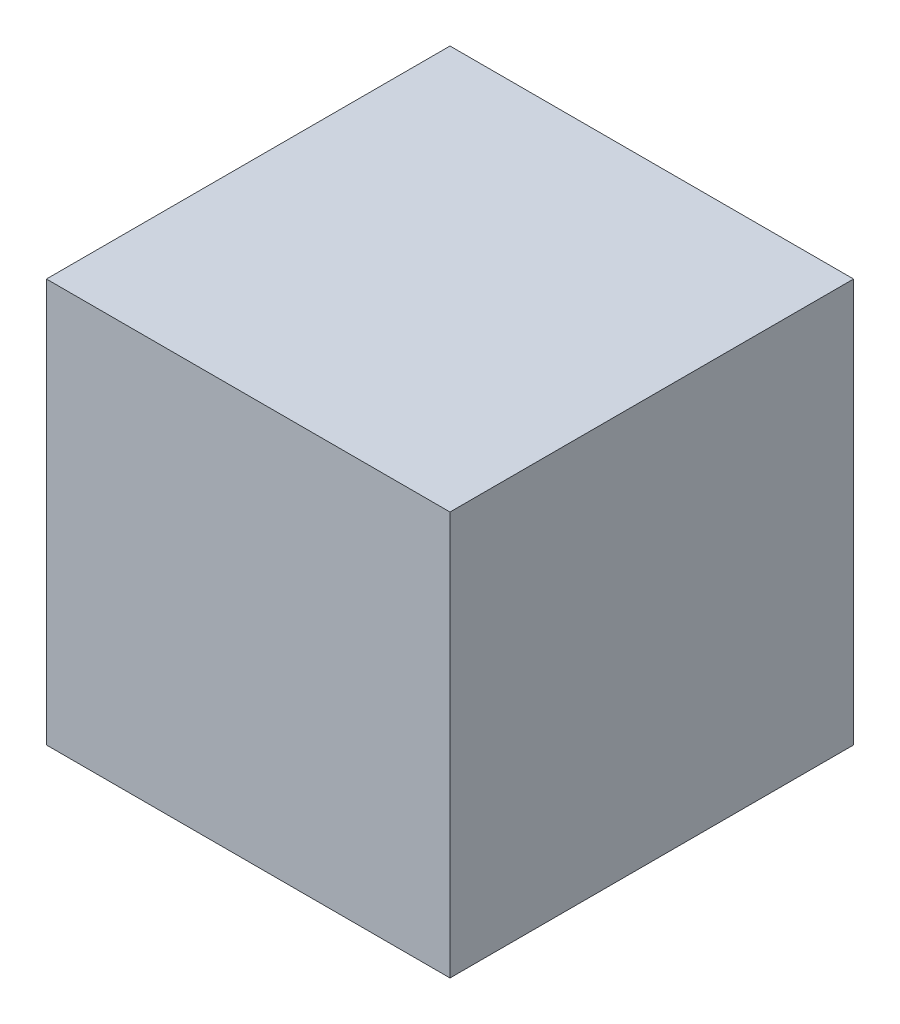
ISO-10303-21;
HEADER;
FILE_DESCRIPTION(('STEP AP214'),'2;1');
FILE_NAME('part.step','',(''),(''),'','','');
FILE_SCHEMA(('AUTOMOTIVE_DESIGN { 1 0 10303 214 1 1 1 1 }'));
ENDSEC;
DATA;
#1=APPLICATION_CONTEXT('core data for automotive mechanical design processes');
#2=APPLICATION_PROTOCOL_DEFINITION('international standard','automotive_design',2000,#1);
#3=PRODUCT_CONTEXT('',#1,'mechanical');
#4=PRODUCT('Part','Part','',(#3));
#5=PRODUCT_RELATED_PRODUCT_CATEGORY('part','',(#4));
#6=PRODUCT_DEFINITION_FORMATION('','',#4);
#7=PRODUCT_DEFINITION_CONTEXT('part definition',#1,'design');
#8=PRODUCT_DEFINITION('design','',#6,#7);
#9=PRODUCT_DEFINITION_SHAPE('','',#8);
#10=(LENGTH_UNIT() NAMED_UNIT(*) SI_UNIT(.MILLI.,.METRE.));
#11=(NAMED_UNIT(*) PLANE_ANGLE_UNIT() SI_UNIT($,.RADIAN.));
#12=(NAMED_UNIT(*) SI_UNIT($,.STERADIAN.) SOLID_ANGLE_UNIT());
#13=UNCERTAINTY_MEASURE_WITH_UNIT(LENGTH_MEASURE(1.E-05),#10,'distance_accuracy_value','');
#14=(GEOMETRIC_REPRESENTATION_CONTEXT(3) GLOBAL_UNCERTAINTY_ASSIGNED_CONTEXT((#13)) GLOBAL_UNIT_ASSIGNED_CONTEXT((#10,
#11,#12)) REPRESENTATION_CONTEXT('',''));
#15=CARTESIAN_POINT('',(0.,0.,0.));
#16=DIRECTION('',(0.,0.,1.));
#17=DIRECTION('',(1.,0.,0.));
#18=AXIS2_PLACEMENT_3D('',#15,#16,#17);
#19=CARTESIAN_POINT('',(-43.7767172996609,1219.2,-1172.49507418531));
#20=DIRECTION('',(1.,0.,0.));
#21=DIRECTION('',(0.,0.,-1.));
#22=AXIS2_PLACEMENT_3D('',#19,#20,#21);
#23=PLANE('',#22);
#24=DIRECTION('',(0.,0.,1.));
#25=VECTOR('',#24,1.);
#26=CARTESIAN_POINT('',(-43.7767172996609,0.,-1172.49507418531));
#27=LINE('',#26,#25);
#28=CARTESIAN_POINT('',(-43.7767172996609,0.,-1172.49507418531));
#29=VERTEX_POINT('',#28);
#30=CARTESIAN_POINT('',(-43.7767172996607,0.,46.7049258146882));
#31=VERTEX_POINT('',#30);
#32=EDGE_CURVE('E94',#29,#31,#27,.T.);
#33=ORIENTED_EDGE('',*,*,#32,.T.);
#34=DIRECTION('',(0.,-1.,0.));
#35=VECTOR('',#34,1.);
#36=CARTESIAN_POINT('',(-43.7767172996607,1219.2,46.7049258146882));
#37=LINE('',#36,#35);
#38=CARTESIAN_POINT('',(-43.7767172996607,1219.2,46.7049258146882));
#39=VERTEX_POINT('',#38);
#40=EDGE_CURVE('E11',#39,#31,#37,.T.);
#41=ORIENTED_EDGE('',*,*,#40,.F.);
#42=DIRECTION('',(0.,0.,1.));
#43=VECTOR('',#42,1.);
#44=CARTESIAN_POINT('',(-43.7767172996609,1219.2,-1172.49507418531));
#45=LINE('',#44,#43);
#46=CARTESIAN_POINT('',(-43.7767172996609,1219.2,-1172.49507418531));
#47=VERTEX_POINT('',#46);
#48=EDGE_CURVE('E82',#47,#39,#45,.T.);
#49=ORIENTED_EDGE('',*,*,#48,.F.);
#50=DIRECTION('',(0.,-1.,0.));
#51=VECTOR('',#50,1.);
#52=CARTESIAN_POINT('',(-43.7767172996609,1219.2,-1172.49507418531));
#53=LINE('',#52,#51);
#54=EDGE_CURVE('E90',#47,#29,#53,.T.);
#55=ORIENTED_EDGE('',*,*,#54,.T.);
#56=EDGE_LOOP('',(#33,#41,#49,#55));
#57=FACE_BOUND('',#56,.T.);
#58=ADVANCED_FACE('F31',(#57),#23,.F.);
#59=CARTESIAN_POINT('',(-43.7767172996607,1219.2,46.7049258146882));
#60=DIRECTION('',(0.,0.,-1.));
#61=DIRECTION('',(-1.,0.,0.));
#62=AXIS2_PLACEMENT_3D('',#59,#60,#61);
#63=PLANE('',#62);
#64=DIRECTION('',(1.,0.,0.));
#65=VECTOR('',#64,1.);
#66=CARTESIAN_POINT('',(-43.7767172996607,0.,46.7049258146882));
#67=LINE('',#66,#65);
#68=CARTESIAN_POINT('',(1175.42328270034,0.,46.7049258146882));
#69=VERTEX_POINT('',#68);
#70=EDGE_CURVE('E86',#31,#69,#67,.T.);
#71=ORIENTED_EDGE('',*,*,#70,.T.);
#72=DIRECTION('',(0.,-1.,0.));
#73=VECTOR('',#72,1.);
#74=CARTESIAN_POINT('',(1175.42328270034,1219.2,46.7049258146882));
#75=LINE('',#74,#73);
#76=CARTESIAN_POINT('',(1175.42328270034,1219.2,46.7049258146882));
#77=VERTEX_POINT('',#76);
#78=EDGE_CURVE('E39',#77,#69,#75,.T.);
#79=ORIENTED_EDGE('',*,*,#78,.F.);
#80=DIRECTION('',(1.,0.,0.));
#81=VECTOR('',#80,1.);
#82=CARTESIAN_POINT('',(-43.7767172996607,1219.2,46.7049258146882));
#83=LINE('',#82,#81);
#84=EDGE_CURVE('E77',#39,#77,#83,.T.);
#85=ORIENTED_EDGE('',*,*,#84,.F.);
#86=ORIENTED_EDGE('',*,*,#40,.T.);
#87=EDGE_LOOP('',(#71,#79,#85,#86));
#88=FACE_BOUND('',#87,.T.);
#89=ADVANCED_FACE('F85',(#88),#63,.F.);
#90=CARTESIAN_POINT('',(1175.42328270034,1219.2,-1172.49507418531));
#91=DIRECTION('',(-1.,0.,0.));
#92=DIRECTION('',(0.,0.,1.));
#93=AXIS2_PLACEMENT_3D('',#90,#91,#92);
#94=PLANE('',#93);
#95=DIRECTION('',(0.,0.,-1.));
#96=VECTOR('',#95,1.);
#97=CARTESIAN_POINT('',(1175.42328270034,0.,-1172.49507418531));
#98=LINE('',#97,#96);
#99=CARTESIAN_POINT('',(1175.42328270034,0.,-1172.49507418531));
#100=VERTEX_POINT('',#99);
#101=EDGE_CURVE('E64',#69,#100,#98,.T.);
#102=ORIENTED_EDGE('',*,*,#101,.T.);
#103=DIRECTION('',(0.,-1.,0.));
#104=VECTOR('',#103,1.);
#105=CARTESIAN_POINT('',(1175.42328270034,1219.2,-1172.49507418531));
#106=LINE('',#105,#104);
#107=CARTESIAN_POINT('',(1175.42328270034,1219.2,-1172.49507418531));
#108=VERTEX_POINT('',#107);
#109=EDGE_CURVE('E87',#108,#100,#106,.T.);
#110=ORIENTED_EDGE('',*,*,#109,.F.);
#111=DIRECTION('',(0.,0.,-1.));
#112=VECTOR('',#111,1.);
#113=CARTESIAN_POINT('',(1175.42328270034,1219.2,-1172.49507418531));
#114=LINE('',#113,#112);
#115=EDGE_CURVE('E80',#77,#108,#114,.T.);
#116=ORIENTED_EDGE('',*,*,#115,.F.);
#117=ORIENTED_EDGE('',*,*,#78,.T.);
#118=EDGE_LOOP('',(#102,#110,#116,#117));
#119=FACE_BOUND('',#118,.T.);
#120=ADVANCED_FACE('F88',(#119),#94,.F.);
#121=CARTESIAN_POINT('',(-43.7767172996609,1219.2,-1172.49507418531));
#122=DIRECTION('',(0.,0.,1.));
#123=DIRECTION('',(1.,0.,0.));
#124=AXIS2_PLACEMENT_3D('',#121,#122,#123);
#125=PLANE('',#124);
#126=DIRECTION('',(-1.,0.,0.));
#127=VECTOR('',#126,1.);
#128=CARTESIAN_POINT('',(-43.7767172996609,0.,-1172.49507418531));
#129=LINE('',#128,#127);
#130=EDGE_CURVE('E70',#100,#29,#129,.T.);
#131=ORIENTED_EDGE('',*,*,#130,.T.);
#132=ORIENTED_EDGE('',*,*,#54,.F.);
#133=DIRECTION('',(-1.,0.,0.));
#134=VECTOR('',#133,1.);
#135=CARTESIAN_POINT('',(-43.7767172996609,1219.2,-1172.49507418531));
#136=LINE('',#135,#134);
#137=EDGE_CURVE('E47',#108,#47,#136,.T.);
#138=ORIENTED_EDGE('',*,*,#137,.F.);
#139=ORIENTED_EDGE('',*,*,#109,.T.);
#140=EDGE_LOOP('',(#131,#132,#138,#139));
#141=FACE_BOUND('',#140,.T.);
#142=ADVANCED_FACE('F101',(#141),#125,.F.);
#143=CARTESIAN_POINT('',(-43.7767172996607,1219.2,46.7049258146882));
#144=DIRECTION('',(0.,1.,0.));
#145=DIRECTION('',(0.,0.,1.));
#146=AXIS2_PLACEMENT_3D('',#143,#144,#145);
#147=PLANE('',#146);
#148=ORIENTED_EDGE('',*,*,#48,.T.);
#149=ORIENTED_EDGE('',*,*,#84,.T.);
#150=ORIENTED_EDGE('',*,*,#115,.T.);
#151=ORIENTED_EDGE('',*,*,#137,.T.);
#152=EDGE_LOOP('',(#148,#149,#150,#151));
#153=FACE_BOUND('',#152,.T.);
#154=ADVANCED_FACE('F78',(#153),#147,.T.);
#155=CARTESIAN_POINT('',(-43.7767172996607,0.,46.7049258146882));
#156=DIRECTION('',(0.,1.,0.));
#157=DIRECTION('',(0.,0.,1.));
#158=AXIS2_PLACEMENT_3D('',#155,#156,#157);
#159=PLANE('',#158);
#160=ORIENTED_EDGE('',*,*,#32,.F.);
#161=ORIENTED_EDGE('',*,*,#130,.F.);
#162=ORIENTED_EDGE('',*,*,#101,.F.);
#163=ORIENTED_EDGE('',*,*,#70,.F.);
#164=EDGE_LOOP('',(#160,#161,#162,#163));
#165=FACE_BOUND('',#164,.T.);
#166=ADVANCED_FACE('F104',(#165),#159,.F.);
#167=CLOSED_SHELL('',(#58,#89,#120,#142,#154,#166));
#168=MANIFOLD_SOLID_BREP('B2',#167);
#169=ADVANCED_BREP_SHAPE_REPRESENTATION('',(#18,#168),#14);
#170=SHAPE_DEFINITION_REPRESENTATION(#9,#169);
ENDSEC;
END-ISO-10303-21;
